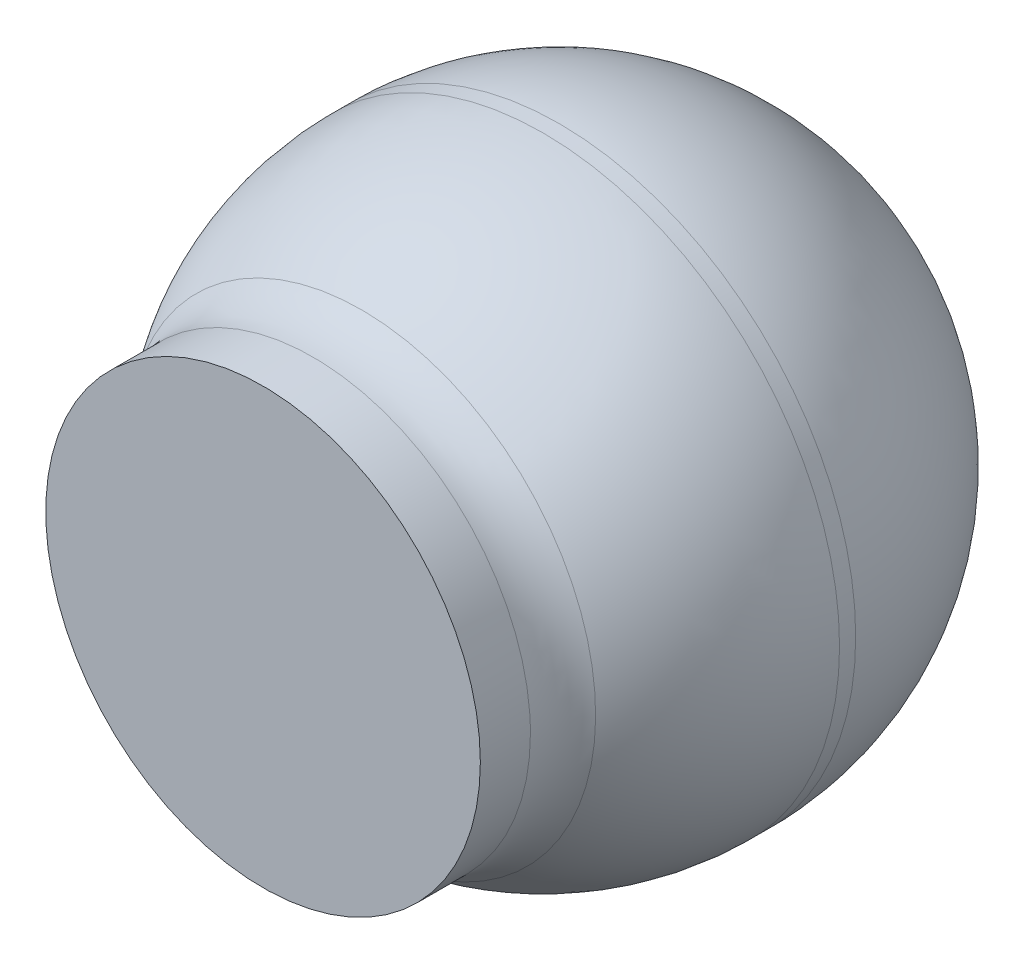
ISO-10303-21;
HEADER;
FILE_DESCRIPTION(('STEP AP214'),'2;1');
FILE_NAME('part.step','',(''),(''),'','','');
FILE_SCHEMA(('AUTOMOTIVE_DESIGN { 1 0 10303 214 1 1 1 1 }'));
ENDSEC;
DATA;
#1=APPLICATION_CONTEXT('core data for automotive mechanical design processes');
#2=APPLICATION_PROTOCOL_DEFINITION('international standard','automotive_design',2000,#1);
#3=PRODUCT_CONTEXT('',#1,'mechanical');
#4=PRODUCT('Part','Part','',(#3));
#5=PRODUCT_RELATED_PRODUCT_CATEGORY('part','',(#4));
#6=PRODUCT_DEFINITION_FORMATION('','',#4);
#7=PRODUCT_DEFINITION_CONTEXT('part definition',#1,'design');
#8=PRODUCT_DEFINITION('design','',#6,#7);
#9=PRODUCT_DEFINITION_SHAPE('','',#8);
#10=(LENGTH_UNIT() NAMED_UNIT(*) SI_UNIT(.MILLI.,.METRE.));
#11=(NAMED_UNIT(*) PLANE_ANGLE_UNIT() SI_UNIT($,.RADIAN.));
#12=(NAMED_UNIT(*) SI_UNIT($,.STERADIAN.) SOLID_ANGLE_UNIT());
#13=UNCERTAINTY_MEASURE_WITH_UNIT(LENGTH_MEASURE(1.E-05),#10,'distance_accuracy_value','');
#14=(GEOMETRIC_REPRESENTATION_CONTEXT(3) GLOBAL_UNCERTAINTY_ASSIGNED_CONTEXT((#13)) GLOBAL_UNIT_ASSIGNED_CONTEXT((#10,
#11,#12)) REPRESENTATION_CONTEXT('',''));
#15=CARTESIAN_POINT('',(0.,0.,0.));
#16=DIRECTION('',(0.,0.,1.));
#17=DIRECTION('',(1.,0.,0.));
#18=AXIS2_PLACEMENT_3D('',#15,#16,#17);
#19=CARTESIAN_POINT('',(-8.182919922269,-9.131349291452,10.006534503384));
#20=DIRECTION('',(0.,0.,-1.));
#21=DIRECTION('',(-1.,0.,0.));
#22=AXIS2_PLACEMENT_3D('',#19,#20,#21);
#23=PLANE('',#22);
#24=CARTESIAN_POINT('',(-8.182919922269,-9.131349291452,10.006534503384));
#25=DIRECTION('',(0.,0.,1.));
#26=DIRECTION('',(1.,0.,0.));
#27=AXIS2_PLACEMENT_3D('',#24,#25,#26);
#28=CIRCLE('',#27,0.275);
#29=CARTESIAN_POINT('',(-7.907919922269,-9.131349291452,10.006534503384));
#30=VERTEX_POINT('',#29);
#31=EDGE_CURVE('E20',#30,#30,#28,.F.);
#32=ORIENTED_EDGE('',*,*,#31,.F.);
#33=EDGE_LOOP('',(#32));
#34=FACE_BOUND('',#33,.T.);
#35=ADVANCED_FACE('F17',(#34),#23,.F.);
#36=CARTESIAN_POINT('',(-8.182919922269,-9.131349291452,9.906534503384));
#37=DIRECTION('',(0.,0.,1.));
#38=DIRECTION('',(1.,0.,0.));
#39=AXIS2_PLACEMENT_3D('',#36,#37,#38);
#40=CYLINDRICAL_SURFACE('',#39,0.275);
#41=CARTESIAN_POINT('',(-8.182919922269,-9.131349291452,9.943180457728));
#42=DIRECTION('',(0.,0.,-1.));
#43=DIRECTION('',(0.996700902337582,0.0811622527992467,0.));
#44=AXIS2_PLACEMENT_3D('',#41,#42,#43);
#45=CIRCLE('',#44,0.275000000000001);
#46=CARTESIAN_POINT('',(-7.90882717412616,-9.10902967193221,9.943180457728));
#47=VERTEX_POINT('',#46);
#48=EDGE_CURVE('E65',#47,#47,#45,.F.);
#49=ORIENTED_EDGE('',*,*,#48,.T.);
#50=EDGE_LOOP('',(#49));
#51=FACE_BOUND('',#50,.T.);
#52=ORIENTED_EDGE('',*,*,#31,.T.);
#53=EDGE_LOOP('',(#52));
#54=FACE_BOUND('',#53,.T.);
#55=ADVANCED_FACE('F62',(#51,#54),#40,.T.);
#56=CARTESIAN_POINT('',(-8.182919922269,-9.131349291452,9.943180457728));
#57=DIRECTION('',(0.,0.,-1.));
#58=DIRECTION('',(0.996700902337583,0.0811622527992448,0.));
#59=AXIS2_PLACEMENT_3D('',#56,#57,#58);
#60=TOROIDAL_SURFACE('',#59,0.375,0.1);
#61=ORIENTED_EDGE('',*,*,#48,.F.);
#62=EDGE_LOOP('',(#61));
#63=FACE_BOUND('',#62,.T.);
#64=CARTESIAN_POINT('',(-8.182919922269,-9.131349291452,9.881744931236));
#65=DIRECTION('',(0.,0.,-1.));
#66=DIRECTION('',(-0.996700902337597,-0.0811622527990627,0.));
#67=AXIS2_PLACEMENT_3D('',#64,#65,#66);
#68=CIRCLE('',#67,0.296097046412663);
#69=CARTESIAN_POINT('',(-8.478040115608,-9.155381194786,9.881744931236));
#70=VERTEX_POINT('',#69);
#71=EDGE_CURVE('E39',#70,#70,#68,.T.);
#72=ORIENTED_EDGE('',*,*,#71,.F.);
#73=EDGE_LOOP('',(#72));
#74=FACE_BOUND('',#73,.T.);
#75=ADVANCED_FACE('F57',(#63,#74),#60,.F.);
#76=CARTESIAN_POINT('',(-8.556682760645,-9.161785136252,9.651976062157));
#77=CARTESIAN_POINT('',(-8.556682760645,-9.161785136252,9.701461392103));
#78=CARTESIAN_POINT('',(-8.548526217348,-9.161120941579,9.750947004335));
#79=CARTESIAN_POINT('',(-8.532207085349,-9.159792059952,9.798626332798));
#80=CARTESIAN_POINT('',(-8.508341390838,-9.157848654938,9.842699544317));
#81=CARTESIAN_POINT('',(-8.478040115608,-9.155381194786,9.881744931236));
#82=(BOUNDED_CURVE() B_SPLINE_CURVE(5,(#76,#77,#78,#79,#80,#81),.UNSPECIFIED.,.F.,
.F.) B_SPLINE_CURVE_WITH_KNOTS((6,6),(0.,0.661568582165),
.UNSPECIFIED.) CURVE() GEOMETRIC_REPRESENTATION_ITEM() RATIONAL_B_SPLINE_CURVE((1.,1.,1.,1.,1.,1.)) REPRESENTATION_ITEM(''));
#83=CARTESIAN_POINT('',(-8.182919922269,-9.131349291452,9.651976062157));
#84=DIRECTION('',(0.,0.,-1.));
#85=AXIS1_PLACEMENT('',#83,#84);
#86=SURFACE_OF_REVOLUTION('',#82,#85);
#87=CARTESIAN_POINT('',(-8.182919922269,-9.131349291452,9.651976062157));
#88=DIRECTION('',(0.,0.,1.));
#89=DIRECTION('',(1.,0.,0.));
#90=AXIS2_PLACEMENT_3D('',#87,#88,#89);
#91=CIRCLE('',#90,0.375);
#92=CARTESIAN_POINT('',(-7.807919922269,-9.131349291452,9.651976062157));
#93=VERTEX_POINT('',#92);
#94=EDGE_CURVE('E36',#93,#93,#91,.F.);
#95=ORIENTED_EDGE('',*,*,#94,.F.);
#96=EDGE_LOOP('',(#95));
#97=FACE_BOUND('',#96,.T.);
#98=ORIENTED_EDGE('',*,*,#71,.T.);
#99=EDGE_LOOP('',(#98));
#100=FACE_BOUND('',#99,.T.);
#101=ADVANCED_FACE('F53',(#97,#100),#86,.F.);
#102=CARTESIAN_POINT('',(-8.182919922269,-9.131349291452,9.256534503384));
#103=DIRECTION('',(0.,0.,1.));
#104=DIRECTION('',(1.,0.,0.));
#105=AXIS2_PLACEMENT_3D('',#102,#103,#104);
#106=CYLINDRICAL_SURFACE('',#105,0.375);
#107=CARTESIAN_POINT('',(-8.182919922269,-9.131349291452,9.631534503384));
#108=DIRECTION('',(0.,0.,-1.));
#109=DIRECTION('',(0.0811622527992357,-0.996700902337583,0.));
#110=AXIS2_PLACEMENT_3D('',#107,#108,#109);
#111=CIRCLE('',#110,0.375);
#112=CARTESIAN_POINT('',(-8.15248407746929,-9.50511212982859,9.631534503384));
#113=VERTEX_POINT('',#112);
#114=CARTESIAN_POINT('',(-8.21335576706871,-8.75758645307541,9.631534503384));
#115=VERTEX_POINT('',#114);
#116=EDGE_CURVE('E11',#113,#115,#111,.T.);
#117=ORIENTED_EDGE('',*,*,#116,.F.);
#118=CARTESIAN_POINT('',(-8.182919922269,-9.131349291452,9.631534503384));
#119=DIRECTION('',(3.33436315446763E-12,2.72100352061447E-13,1.));
#120=DIRECTION('',(0.0811622527992365,-0.996700902337583,0.));
#121=AXIS2_PLACEMENT_3D('',#118,#119,#120);
#122=CIRCLE('',#121,0.375);
#123=EDGE_CURVE('E25',#115,#113,#122,.F.);
#124=ORIENTED_EDGE('',*,*,#123,.F.);
#125=EDGE_LOOP('',(#117,#124));
#126=FACE_BOUND('',#125,.T.);
#127=ORIENTED_EDGE('',*,*,#94,.T.);
#128=EDGE_LOOP('',(#127));
#129=FACE_BOUND('',#128,.T.);
#130=ADVANCED_FACE('F34',(#126,#129),#106,.T.);
#131=CARTESIAN_POINT('',(-8.182919922269,-9.131349291452,9.631534503384));
#132=DIRECTION('',(0.0811622527992361,-0.996700902337583,0.));
#133=DIRECTION('',(-0.996700902337583,-0.0811622527992361,0.));
#134=AXIS2_PLACEMENT_3D('',#131,#132,#133);
#135=SPHERICAL_SURFACE('',#134,0.375);
#136=ORIENTED_EDGE('',*,*,#123,.T.);
#137=ORIENTED_EDGE('',*,*,#116,.T.);
#138=EDGE_LOOP('',(#136,#137));
#139=FACE_BOUND('',#138,.T.);
#140=ADVANCED_FACE('F32',(#139),#135,.T.);
#141=CLOSED_SHELL('',(#35,#55,#75,#101,#130,#140));
#142=MANIFOLD_SOLID_BREP('B1',#141);
#143=ADVANCED_BREP_SHAPE_REPRESENTATION('',(#18,#142),#14);
#144=SHAPE_DEFINITION_REPRESENTATION(#9,#143);
ENDSEC;
END-ISO-10303-21;
